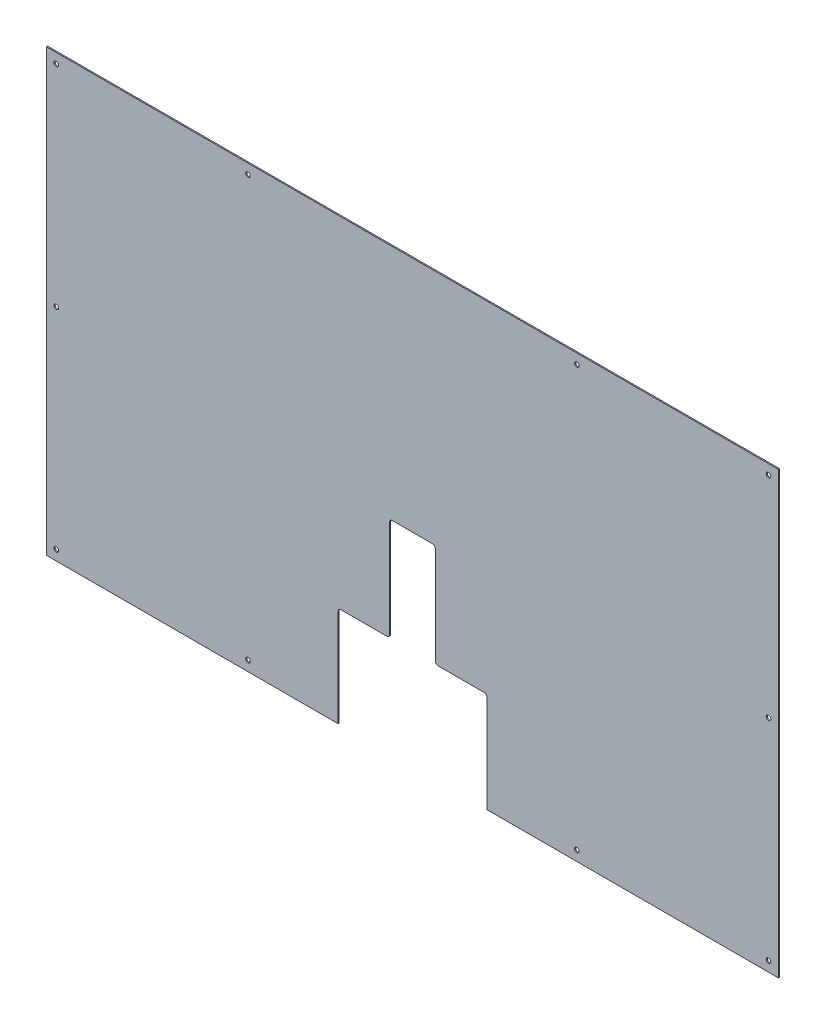
ISO-10303-21;
HEADER;
FILE_DESCRIPTION(('STEP AP214'),'2;1');
FILE_NAME('part.step','',(''),(''),'','','');
FILE_SCHEMA(('AUTOMOTIVE_DESIGN { 1 0 10303 214 1 1 1 1 }'));
ENDSEC;
DATA;
#1=APPLICATION_CONTEXT('core data for automotive mechanical design processes');
#2=APPLICATION_PROTOCOL_DEFINITION('international standard','automotive_design',2000,#1);
#3=PRODUCT_CONTEXT('',#1,'mechanical');
#4=PRODUCT('Part','Part','',(#3));
#5=PRODUCT_RELATED_PRODUCT_CATEGORY('part','',(#4));
#6=PRODUCT_DEFINITION_FORMATION('','',#4);
#7=PRODUCT_DEFINITION_CONTEXT('part definition',#1,'design');
#8=PRODUCT_DEFINITION('design','',#6,#7);
#9=PRODUCT_DEFINITION_SHAPE('','',#8);
#10=(LENGTH_UNIT() NAMED_UNIT(*) SI_UNIT(.MILLI.,.METRE.));
#11=(NAMED_UNIT(*) PLANE_ANGLE_UNIT() SI_UNIT($,.RADIAN.));
#12=(NAMED_UNIT(*) SI_UNIT($,.STERADIAN.) SOLID_ANGLE_UNIT());
#13=UNCERTAINTY_MEASURE_WITH_UNIT(LENGTH_MEASURE(1.E-05),#10,'distance_accuracy_value','');
#14=(GEOMETRIC_REPRESENTATION_CONTEXT(3) GLOBAL_UNCERTAINTY_ASSIGNED_CONTEXT((#13)) GLOBAL_UNIT_ASSIGNED_CONTEXT((#10,
#11,#12)) REPRESENTATION_CONTEXT('',''));
#15=CARTESIAN_POINT('',(0.,0.,0.));
#16=DIRECTION('',(0.,0.,1.));
#17=DIRECTION('',(1.,0.,0.));
#18=AXIS2_PLACEMENT_3D('',#15,#16,#17);
#19=CARTESIAN_POINT('',(765.,170.,2.));
#20=DIRECTION('',(0.,0.,1.));
#21=DIRECTION('',(1.,0.,0.));
#22=AXIS2_PLACEMENT_3D('',#19,#20,#21);
#23=PLANE('',#22);
#24=CARTESIAN_POINT('',(17.5000000000001,385.,2.));
#25=DIRECTION('',(0.,0.,1.));
#26=DIRECTION('',(1.,0.,0.));
#27=AXIS2_PLACEMENT_3D('',#24,#25,#26);
#28=CIRCLE('',#27,4.);
#29=CARTESIAN_POINT('',(21.5000000000001,385.,2.));
#30=VERTEX_POINT('',#29);
#31=EDGE_CURVE('E393',#30,#30,#28,.T.);
#32=ORIENTED_EDGE('',*,*,#31,.F.);
#33=EDGE_LOOP('',(#32));
#34=FACE_BOUND('',#33,.T.);
#35=CARTESIAN_POINT('',(927.5,17.5,2.));
#36=DIRECTION('',(0.,0.,1.));
#37=DIRECTION('',(1.,0.,0.));
#38=AXIS2_PLACEMENT_3D('',#35,#36,#37);
#39=CIRCLE('',#38,3.99999999999999);
#40=CARTESIAN_POINT('',(931.5,17.5,2.));
#41=VERTEX_POINT('',#40);
#42=EDGE_CURVE('E405',#41,#41,#39,.T.);
#43=ORIENTED_EDGE('',*,*,#42,.F.);
#44=EDGE_LOOP('',(#43));
#45=FACE_BOUND('',#44,.T.);
#46=CARTESIAN_POINT('',(352.5,752.5,2.));
#47=DIRECTION('',(0.,0.,1.));
#48=DIRECTION('',(1.,0.,0.));
#49=AXIS2_PLACEMENT_3D('',#46,#47,#48);
#50=CIRCLE('',#49,3.99999999999999);
#51=CARTESIAN_POINT('',(356.5,752.5,2.));
#52=VERTEX_POINT('',#51);
#53=EDGE_CURVE('E417',#52,#52,#50,.T.);
#54=ORIENTED_EDGE('',*,*,#53,.F.);
#55=EDGE_LOOP('',(#54));
#56=FACE_BOUND('',#55,.T.);
#57=CARTESIAN_POINT('',(1262.5,17.5,2.));
#58=DIRECTION('',(0.,0.,1.));
#59=DIRECTION('',(1.,0.,0.));
#60=AXIS2_PLACEMENT_3D('',#57,#58,#59);
#61=CIRCLE('',#60,4.00000000000021);
#62=CARTESIAN_POINT('',(1266.5,17.5,2.));
#63=VERTEX_POINT('',#62);
#64=EDGE_CURVE('E429',#63,#63,#61,.T.);
#65=ORIENTED_EDGE('',*,*,#64,.F.);
#66=EDGE_LOOP('',(#65));
#67=FACE_BOUND('',#66,.T.);
#68=CARTESIAN_POINT('',(17.5,752.5,2.));
#69=DIRECTION('',(0.,0.,1.));
#70=DIRECTION('',(1.,0.,0.));
#71=AXIS2_PLACEMENT_3D('',#68,#69,#70);
#72=CIRCLE('',#71,4.);
#73=CARTESIAN_POINT('',(21.5,752.5,2.));
#74=VERTEX_POINT('',#73);
#75=EDGE_CURVE('E193',#74,#74,#72,.T.);
#76=ORIENTED_EDGE('',*,*,#75,.F.);
#77=EDGE_LOOP('',(#76));
#78=FACE_BOUND('',#77,.T.);
#79=DIRECTION('',(1.,0.,0.));
#80=VECTOR('',#79,1.);
#81=CARTESIAN_POINT('',(510.,0.,2.));
#82=LINE('',#81,#80);
#83=CARTESIAN_POINT('',(0.,0.,2.));
#84=VERTEX_POINT('',#83);
#85=CARTESIAN_POINT('',(510.,0.,2.));
#86=VERTEX_POINT('',#85);
#87=EDGE_CURVE('E224',#84,#86,#82,.T.);
#88=ORIENTED_EDGE('',*,*,#87,.T.);
#89=DIRECTION('',(0.,1.,0.));
#90=VECTOR('',#89,1.);
#91=CARTESIAN_POINT('',(510.,0.,2.));
#92=LINE('',#91,#90);
#93=CARTESIAN_POINT('',(510.,170.,2.));
#94=VERTEX_POINT('',#93);
#95=EDGE_CURVE('E122',#86,#94,#92,.T.);
#96=ORIENTED_EDGE('',*,*,#95,.T.);
#97=CARTESIAN_POINT('',(515.,170.,2.));
#98=DIRECTION('',(0.,0.,-1.));
#99=DIRECTION('',(-1.,0.,0.));
#100=AXIS2_PLACEMENT_3D('',#97,#98,#99);
#101=CIRCLE('',#100,4.99999999999999);
#102=CARTESIAN_POINT('',(515.,175.,2.));
#103=VERTEX_POINT('',#102);
#104=EDGE_CURVE('E269',#94,#103,#101,.T.);
#105=ORIENTED_EDGE('',*,*,#104,.T.);
#106=DIRECTION('',(1.,0.,0.));
#107=VECTOR('',#106,1.);
#108=CARTESIAN_POINT('',(515.,175.,2.));
#109=LINE('',#108,#107);
#110=CARTESIAN_POINT('',(595.,175.,2.));
#111=VERTEX_POINT('',#110);
#112=EDGE_CURVE('E288',#103,#111,#109,.T.);
#113=ORIENTED_EDGE('',*,*,#112,.T.);
#114=CARTESIAN_POINT('',(595.,180.,2.));
#115=DIRECTION('',(0.,0.,1.));
#116=DIRECTION('',(1.,0.,0.));
#117=AXIS2_PLACEMENT_3D('',#114,#115,#116);
#118=CIRCLE('',#117,5.00000000000002);
#119=CARTESIAN_POINT('',(600.,180.,2.));
#120=VERTEX_POINT('',#119);
#121=EDGE_CURVE('E285',#111,#120,#118,.T.);
#122=ORIENTED_EDGE('',*,*,#121,.T.);
#123=DIRECTION('',(0.,1.,0.));
#124=VECTOR('',#123,1.);
#125=CARTESIAN_POINT('',(600.,180.,2.));
#126=LINE('',#125,#124);
#127=CARTESIAN_POINT('',(600.,350.,2.));
#128=VERTEX_POINT('',#127);
#129=EDGE_CURVE('E287',#120,#128,#126,.T.);
#130=ORIENTED_EDGE('',*,*,#129,.T.);
#131=CARTESIAN_POINT('',(605.,350.,2.));
#132=DIRECTION('',(0.,0.,-1.));
#133=DIRECTION('',(1.,0.,0.));
#134=AXIS2_PLACEMENT_3D('',#131,#132,#133);
#135=CIRCLE('',#134,4.99999999999998);
#136=CARTESIAN_POINT('',(605.,355.,2.));
#137=VERTEX_POINT('',#136);
#138=EDGE_CURVE('E290',#128,#137,#135,.T.);
#139=ORIENTED_EDGE('',*,*,#138,.T.);
#140=DIRECTION('',(1.,0.,0.));
#141=VECTOR('',#140,1.);
#142=CARTESIAN_POINT('',(605.,355.,2.));
#143=LINE('',#142,#141);
#144=CARTESIAN_POINT('',(675.,355.,2.));
#145=VERTEX_POINT('',#144);
#146=EDGE_CURVE('E296',#137,#145,#143,.T.);
#147=ORIENTED_EDGE('',*,*,#146,.T.);
#148=CARTESIAN_POINT('',(675.,350.,2.));
#149=DIRECTION('',(0.,0.,-1.));
#150=DIRECTION('',(1.,0.,0.));
#151=AXIS2_PLACEMENT_3D('',#148,#149,#150);
#152=CIRCLE('',#151,5.00000000000006);
#153=CARTESIAN_POINT('',(680.,350.,2.));
#154=VERTEX_POINT('',#153);
#155=EDGE_CURVE('E298',#145,#154,#152,.T.);
#156=ORIENTED_EDGE('',*,*,#155,.T.);
#157=DIRECTION('',(0.,-1.,0.));
#158=VECTOR('',#157,1.);
#159=CARTESIAN_POINT('',(680.,180.,2.));
#160=LINE('',#159,#158);
#161=CARTESIAN_POINT('',(680.,180.,2.));
#162=VERTEX_POINT('',#161);
#163=EDGE_CURVE('E300',#154,#162,#160,.T.);
#164=ORIENTED_EDGE('',*,*,#163,.T.);
#165=CARTESIAN_POINT('',(685.,180.,2.));
#166=DIRECTION('',(0.,0.,1.));
#167=DIRECTION('',(-1.,0.,0.));
#168=AXIS2_PLACEMENT_3D('',#165,#166,#167);
#169=CIRCLE('',#168,4.99999999999995);
#170=CARTESIAN_POINT('',(685.,175.,2.));
#171=VERTEX_POINT('',#170);
#172=EDGE_CURVE('E302',#162,#171,#169,.T.);
#173=ORIENTED_EDGE('',*,*,#172,.T.);
#174=DIRECTION('',(1.,0.,0.));
#175=VECTOR('',#174,1.);
#176=CARTESIAN_POINT('',(765.,175.,2.));
#177=LINE('',#176,#175);
#178=CARTESIAN_POINT('',(765.,175.,2.));
#179=VERTEX_POINT('',#178);
#180=EDGE_CURVE('E304',#171,#179,#177,.T.);
#181=ORIENTED_EDGE('',*,*,#180,.T.);
#182=CARTESIAN_POINT('',(765.,170.,2.));
#183=DIRECTION('',(0.,0.,-1.));
#184=DIRECTION('',(1.,0.,0.));
#185=AXIS2_PLACEMENT_3D('',#182,#183,#184);
#186=CIRCLE('',#185,5.);
#187=CARTESIAN_POINT('',(770.,170.,2.));
#188=VERTEX_POINT('',#187);
#189=EDGE_CURVE('E306',#179,#188,#186,.T.);
#190=ORIENTED_EDGE('',*,*,#189,.T.);
#191=DIRECTION('',(0.,-1.,0.));
#192=VECTOR('',#191,1.);
#193=CARTESIAN_POINT('',(770.,0.,2.));
#194=LINE('',#193,#192);
#195=CARTESIAN_POINT('',(770.,0.,2.));
#196=VERTEX_POINT('',#195);
#197=EDGE_CURVE('E308',#188,#196,#194,.T.);
#198=ORIENTED_EDGE('',*,*,#197,.T.);
#199=DIRECTION('',(1.,0.,0.));
#200=VECTOR('',#199,1.);
#201=CARTESIAN_POINT('',(1280.,1.43917779840921E-13,2.));
#202=LINE('',#201,#200);
#203=CARTESIAN_POINT('',(1280.,1.43917779840921E-13,2.));
#204=VERTEX_POINT('',#203);
#205=EDGE_CURVE('E171',#196,#204,#202,.T.);
#206=ORIENTED_EDGE('',*,*,#205,.T.);
#207=DIRECTION('',(0.,1.,0.));
#208=VECTOR('',#207,1.);
#209=CARTESIAN_POINT('',(1280.,770.,2.));
#210=LINE('',#209,#208);
#211=CARTESIAN_POINT('',(1280.,770.,2.));
#212=VERTEX_POINT('',#211);
#213=EDGE_CURVE('E165',#204,#212,#210,.T.);
#214=ORIENTED_EDGE('',*,*,#213,.T.);
#215=DIRECTION('',(-1.,0.,0.));
#216=VECTOR('',#215,1.);
#217=CARTESIAN_POINT('',(0.,770.,2.));
#218=LINE('',#217,#216);
#219=CARTESIAN_POINT('',(0.,770.,2.));
#220=VERTEX_POINT('',#219);
#221=EDGE_CURVE('E169',#212,#220,#218,.T.);
#222=ORIENTED_EDGE('',*,*,#221,.T.);
#223=DIRECTION('',(0.,-1.,0.));
#224=VECTOR('',#223,1.);
#225=CARTESIAN_POINT('',(0.,0.,2.));
#226=LINE('',#225,#224);
#227=EDGE_CURVE('E49',#220,#84,#226,.T.);
#228=ORIENTED_EDGE('',*,*,#227,.T.);
#229=EDGE_LOOP('',(#88,#96,#105,#113,#122,#130,#139,#147,#156,#164,#173,#181,#190,#198,#206,
#214,#222,#228));
#230=FACE_BOUND('',#229,.T.);
#231=CARTESIAN_POINT('',(1262.5,752.5,2.));
#232=DIRECTION('',(0.,0.,1.));
#233=DIRECTION('',(-1.,0.,0.));
#234=AXIS2_PLACEMENT_3D('',#231,#232,#233);
#235=CIRCLE('',#234,4.00000000000024);
#236=CARTESIAN_POINT('',(1258.5,752.5,2.));
#237=VERTEX_POINT('',#236);
#238=EDGE_CURVE('E435',#237,#237,#235,.T.);
#239=ORIENTED_EDGE('',*,*,#238,.F.);
#240=EDGE_LOOP('',(#239));
#241=FACE_BOUND('',#240,.T.);
#242=CARTESIAN_POINT('',(17.5,17.5,2.));
#243=DIRECTION('',(0.,0.,1.));
#244=DIRECTION('',(-1.,0.,0.));
#245=AXIS2_PLACEMENT_3D('',#242,#243,#244);
#246=CIRCLE('',#245,4.);
#247=CARTESIAN_POINT('',(13.5,17.5,2.));
#248=VERTEX_POINT('',#247);
#249=EDGE_CURVE('E423',#248,#248,#246,.T.);
#250=ORIENTED_EDGE('',*,*,#249,.F.);
#251=EDGE_LOOP('',(#250));
#252=FACE_BOUND('',#251,.T.);
#253=CARTESIAN_POINT('',(927.5,752.5,2.));
#254=DIRECTION('',(0.,0.,1.));
#255=DIRECTION('',(-1.,0.,0.));
#256=AXIS2_PLACEMENT_3D('',#253,#254,#255);
#257=CIRCLE('',#256,3.99999999999999);
#258=CARTESIAN_POINT('',(923.5,752.5,2.));
#259=VERTEX_POINT('',#258);
#260=EDGE_CURVE('E411',#259,#259,#257,.T.);
#261=ORIENTED_EDGE('',*,*,#260,.F.);
#262=EDGE_LOOP('',(#261));
#263=FACE_BOUND('',#262,.T.);
#264=CARTESIAN_POINT('',(352.5,17.5,2.));
#265=DIRECTION('',(0.,0.,1.));
#266=DIRECTION('',(-1.,0.,0.));
#267=AXIS2_PLACEMENT_3D('',#264,#265,#266);
#268=CIRCLE('',#267,3.99999999999999);
#269=CARTESIAN_POINT('',(348.5,17.5,2.));
#270=VERTEX_POINT('',#269);
#271=EDGE_CURVE('E399',#270,#270,#268,.T.);
#272=ORIENTED_EDGE('',*,*,#271,.F.);
#273=EDGE_LOOP('',(#272));
#274=FACE_BOUND('',#273,.T.);
#275=CARTESIAN_POINT('',(1262.5,385.,2.));
#276=DIRECTION('',(0.,0.,1.));
#277=DIRECTION('',(-1.,0.,0.));
#278=AXIS2_PLACEMENT_3D('',#275,#276,#277);
#279=CIRCLE('',#278,3.99999999999999);
#280=CARTESIAN_POINT('',(1258.5,385.,2.));
#281=VERTEX_POINT('',#280);
#282=EDGE_CURVE('E384',#281,#281,#279,.T.);
#283=ORIENTED_EDGE('',*,*,#282,.F.);
#284=EDGE_LOOP('',(#283));
#285=FACE_BOUND('',#284,.T.);
#286=ADVANCED_FACE('F32',(#34,#45,#56,#67,#78,#230,#241,#252,#263,#274,#285),#23,.T.);
#287=CARTESIAN_POINT('',(765.,170.,0.));
#288=DIRECTION('',(0.,0.,1.));
#289=DIRECTION('',(1.,0.,0.));
#290=AXIS2_PLACEMENT_3D('',#287,#288,#289);
#291=PLANE('',#290);
#292=CARTESIAN_POINT('',(17.5000000000001,385.,0.));
#293=DIRECTION('',(0.,0.,1.));
#294=DIRECTION('',(1.,0.,0.));
#295=AXIS2_PLACEMENT_3D('',#292,#293,#294);
#296=CIRCLE('',#295,4.);
#297=CARTESIAN_POINT('',(21.5000000000001,385.,0.));
#298=VERTEX_POINT('',#297);
#299=EDGE_CURVE('E390',#298,#298,#296,.T.);
#300=ORIENTED_EDGE('',*,*,#299,.T.);
#301=EDGE_LOOP('',(#300));
#302=FACE_BOUND('',#301,.T.);
#303=CARTESIAN_POINT('',(927.5,17.5,0.));
#304=DIRECTION('',(0.,0.,1.));
#305=DIRECTION('',(1.,0.,0.));
#306=AXIS2_PLACEMENT_3D('',#303,#304,#305);
#307=CIRCLE('',#306,3.99999999999999);
#308=CARTESIAN_POINT('',(931.5,17.5,0.));
#309=VERTEX_POINT('',#308);
#310=EDGE_CURVE('E402',#309,#309,#307,.T.);
#311=ORIENTED_EDGE('',*,*,#310,.T.);
#312=EDGE_LOOP('',(#311));
#313=FACE_BOUND('',#312,.T.);
#314=CARTESIAN_POINT('',(352.5,752.5,0.));
#315=DIRECTION('',(0.,0.,1.));
#316=DIRECTION('',(1.,0.,0.));
#317=AXIS2_PLACEMENT_3D('',#314,#315,#316);
#318=CIRCLE('',#317,3.99999999999999);
#319=CARTESIAN_POINT('',(356.5,752.5,0.));
#320=VERTEX_POINT('',#319);
#321=EDGE_CURVE('E414',#320,#320,#318,.T.);
#322=ORIENTED_EDGE('',*,*,#321,.T.);
#323=EDGE_LOOP('',(#322));
#324=FACE_BOUND('',#323,.T.);
#325=CARTESIAN_POINT('',(1262.5,17.5,0.));
#326=DIRECTION('',(0.,0.,1.));
#327=DIRECTION('',(1.,0.,0.));
#328=AXIS2_PLACEMENT_3D('',#325,#326,#327);
#329=CIRCLE('',#328,4.00000000000021);
#330=CARTESIAN_POINT('',(1266.5,17.5,0.));
#331=VERTEX_POINT('',#330);
#332=EDGE_CURVE('E426',#331,#331,#329,.T.);
#333=ORIENTED_EDGE('',*,*,#332,.T.);
#334=EDGE_LOOP('',(#333));
#335=FACE_BOUND('',#334,.T.);
#336=CARTESIAN_POINT('',(17.5,752.5,0.));
#337=DIRECTION('',(0.,0.,1.));
#338=DIRECTION('',(1.,0.,0.));
#339=AXIS2_PLACEMENT_3D('',#336,#337,#338);
#340=CIRCLE('',#339,4.);
#341=CARTESIAN_POINT('',(21.5,752.5,0.));
#342=VERTEX_POINT('',#341);
#343=EDGE_CURVE('E438',#342,#342,#340,.T.);
#344=ORIENTED_EDGE('',*,*,#343,.T.);
#345=EDGE_LOOP('',(#344));
#346=FACE_BOUND('',#345,.T.);
#347=DIRECTION('',(1.,0.,0.));
#348=VECTOR('',#347,1.);
#349=CARTESIAN_POINT('',(510.,0.,0.));
#350=LINE('',#349,#348);
#351=CARTESIAN_POINT('',(0.,0.,0.));
#352=VERTEX_POINT('',#351);
#353=CARTESIAN_POINT('',(510.,0.,0.));
#354=VERTEX_POINT('',#353);
#355=EDGE_CURVE('E189',#352,#354,#350,.T.);
#356=ORIENTED_EDGE('',*,*,#355,.F.);
#357=DIRECTION('',(0.,-1.,0.));
#358=VECTOR('',#357,1.);
#359=CARTESIAN_POINT('',(0.,0.,0.));
#360=LINE('',#359,#358);
#361=CARTESIAN_POINT('',(0.,770.,0.));
#362=VERTEX_POINT('',#361);
#363=EDGE_CURVE('E114',#362,#352,#360,.T.);
#364=ORIENTED_EDGE('',*,*,#363,.F.);
#365=DIRECTION('',(-1.,0.,0.));
#366=VECTOR('',#365,1.);
#367=CARTESIAN_POINT('',(0.,770.,0.));
#368=LINE('',#367,#366);
#369=CARTESIAN_POINT('',(1280.,770.,0.));
#370=VERTEX_POINT('',#369);
#371=EDGE_CURVE('E108',#370,#362,#368,.T.);
#372=ORIENTED_EDGE('',*,*,#371,.F.);
#373=DIRECTION('',(0.,1.,0.));
#374=VECTOR('',#373,1.);
#375=CARTESIAN_POINT('',(1280.,770.,0.));
#376=LINE('',#375,#374);
#377=CARTESIAN_POINT('',(1280.,1.43917779840921E-13,0.));
#378=VERTEX_POINT('',#377);
#379=EDGE_CURVE('E179',#378,#370,#376,.T.);
#380=ORIENTED_EDGE('',*,*,#379,.F.);
#381=DIRECTION('',(1.,0.,0.));
#382=VECTOR('',#381,1.);
#383=CARTESIAN_POINT('',(1280.,1.43917779840921E-13,0.));
#384=LINE('',#383,#382);
#385=CARTESIAN_POINT('',(770.,0.,0.));
#386=VERTEX_POINT('',#385);
#387=EDGE_CURVE('E219',#386,#378,#384,.T.);
#388=ORIENTED_EDGE('',*,*,#387,.F.);
#389=DIRECTION('',(0.,-1.,0.));
#390=VECTOR('',#389,1.);
#391=CARTESIAN_POINT('',(770.,0.,0.));
#392=LINE('',#391,#390);
#393=CARTESIAN_POINT('',(770.,170.,0.));
#394=VERTEX_POINT('',#393);
#395=EDGE_CURVE('E217',#394,#386,#392,.T.);
#396=ORIENTED_EDGE('',*,*,#395,.F.);
#397=CARTESIAN_POINT('',(765.,170.,0.));
#398=DIRECTION('',(0.,0.,-1.));
#399=DIRECTION('',(1.,0.,0.));
#400=AXIS2_PLACEMENT_3D('',#397,#398,#399);
#401=CIRCLE('',#400,5.);
#402=CARTESIAN_POINT('',(765.,175.,0.));
#403=VERTEX_POINT('',#402);
#404=EDGE_CURVE('E215',#403,#394,#401,.T.);
#405=ORIENTED_EDGE('',*,*,#404,.F.);
#406=DIRECTION('',(1.,0.,0.));
#407=VECTOR('',#406,1.);
#408=CARTESIAN_POINT('',(765.,175.,0.));
#409=LINE('',#408,#407);
#410=CARTESIAN_POINT('',(685.,175.,0.));
#411=VERTEX_POINT('',#410);
#412=EDGE_CURVE('E213',#411,#403,#409,.T.);
#413=ORIENTED_EDGE('',*,*,#412,.F.);
#414=CARTESIAN_POINT('',(685.,180.,0.));
#415=DIRECTION('',(0.,0.,1.));
#416=DIRECTION('',(-1.,0.,0.));
#417=AXIS2_PLACEMENT_3D('',#414,#415,#416);
#418=CIRCLE('',#417,4.99999999999995);
#419=CARTESIAN_POINT('',(680.,180.,0.));
#420=VERTEX_POINT('',#419);
#421=EDGE_CURVE('E211',#420,#411,#418,.T.);
#422=ORIENTED_EDGE('',*,*,#421,.F.);
#423=DIRECTION('',(0.,-1.,0.));
#424=VECTOR('',#423,1.);
#425=CARTESIAN_POINT('',(680.,180.,0.));
#426=LINE('',#425,#424);
#427=CARTESIAN_POINT('',(680.,350.,0.));
#428=VERTEX_POINT('',#427);
#429=EDGE_CURVE('E209',#428,#420,#426,.T.);
#430=ORIENTED_EDGE('',*,*,#429,.F.);
#431=CARTESIAN_POINT('',(675.,350.,0.));
#432=DIRECTION('',(0.,0.,-1.));
#433=DIRECTION('',(1.,0.,0.));
#434=AXIS2_PLACEMENT_3D('',#431,#432,#433);
#435=CIRCLE('',#434,5.00000000000006);
#436=CARTESIAN_POINT('',(675.,355.,0.));
#437=VERTEX_POINT('',#436);
#438=EDGE_CURVE('E207',#437,#428,#435,.T.);
#439=ORIENTED_EDGE('',*,*,#438,.F.);
#440=DIRECTION('',(1.,0.,0.));
#441=VECTOR('',#440,1.);
#442=CARTESIAN_POINT('',(605.,355.,0.));
#443=LINE('',#442,#441);
#444=CARTESIAN_POINT('',(605.,355.,0.));
#445=VERTEX_POINT('',#444);
#446=EDGE_CURVE('E205',#445,#437,#443,.T.);
#447=ORIENTED_EDGE('',*,*,#446,.F.);
#448=CARTESIAN_POINT('',(605.,350.,0.));
#449=DIRECTION('',(0.,0.,-1.));
#450=DIRECTION('',(1.,0.,0.));
#451=AXIS2_PLACEMENT_3D('',#448,#449,#450);
#452=CIRCLE('',#451,4.99999999999998);
#453=CARTESIAN_POINT('',(600.,350.,0.));
#454=VERTEX_POINT('',#453);
#455=EDGE_CURVE('E203',#454,#445,#452,.T.);
#456=ORIENTED_EDGE('',*,*,#455,.F.);
#457=DIRECTION('',(0.,1.,0.));
#458=VECTOR('',#457,1.);
#459=CARTESIAN_POINT('',(600.,180.,0.));
#460=LINE('',#459,#458);
#461=CARTESIAN_POINT('',(600.,180.,0.));
#462=VERTEX_POINT('',#461);
#463=EDGE_CURVE('E201',#462,#454,#460,.T.);
#464=ORIENTED_EDGE('',*,*,#463,.F.);
#465=CARTESIAN_POINT('',(595.,180.,0.));
#466=DIRECTION('',(0.,0.,1.));
#467=DIRECTION('',(1.,0.,0.));
#468=AXIS2_PLACEMENT_3D('',#465,#466,#467);
#469=CIRCLE('',#468,5.00000000000002);
#470=CARTESIAN_POINT('',(595.,175.,0.));
#471=VERTEX_POINT('',#470);
#472=EDGE_CURVE('E199',#471,#462,#469,.T.);
#473=ORIENTED_EDGE('',*,*,#472,.F.);
#474=DIRECTION('',(1.,0.,0.));
#475=VECTOR('',#474,1.);
#476=CARTESIAN_POINT('',(515.,175.,0.));
#477=LINE('',#476,#475);
#478=CARTESIAN_POINT('',(515.,175.,0.));
#479=VERTEX_POINT('',#478);
#480=EDGE_CURVE('E197',#479,#471,#477,.T.);
#481=ORIENTED_EDGE('',*,*,#480,.F.);
#482=CARTESIAN_POINT('',(515.,170.,0.));
#483=DIRECTION('',(0.,0.,-1.));
#484=DIRECTION('',(-1.,0.,0.));
#485=AXIS2_PLACEMENT_3D('',#482,#483,#484);
#486=CIRCLE('',#485,4.99999999999999);
#487=CARTESIAN_POINT('',(510.,170.,0.));
#488=VERTEX_POINT('',#487);
#489=EDGE_CURVE('E195',#488,#479,#486,.T.);
#490=ORIENTED_EDGE('',*,*,#489,.F.);
#491=DIRECTION('',(0.,1.,0.));
#492=VECTOR('',#491,1.);
#493=CARTESIAN_POINT('',(510.,0.,0.));
#494=LINE('',#493,#492);
#495=EDGE_CURVE('E192',#354,#488,#494,.T.);
#496=ORIENTED_EDGE('',*,*,#495,.F.);
#497=EDGE_LOOP('',(#356,#364,#372,#380,#388,#396,#405,#413,#422,#430,#439,#447,#456,#464,#473,
#481,#490,#496));
#498=FACE_BOUND('',#497,.T.);
#499=CARTESIAN_POINT('',(1262.5,752.5,0.));
#500=DIRECTION('',(0.,0.,1.));
#501=DIRECTION('',(-1.,0.,0.));
#502=AXIS2_PLACEMENT_3D('',#499,#500,#501);
#503=CIRCLE('',#502,4.00000000000024);
#504=CARTESIAN_POINT('',(1258.5,752.5,0.));
#505=VERTEX_POINT('',#504);
#506=EDGE_CURVE('E432',#505,#505,#503,.T.);
#507=ORIENTED_EDGE('',*,*,#506,.T.);
#508=EDGE_LOOP('',(#507));
#509=FACE_BOUND('',#508,.T.);
#510=CARTESIAN_POINT('',(17.5,17.5,0.));
#511=DIRECTION('',(0.,0.,1.));
#512=DIRECTION('',(-1.,0.,0.));
#513=AXIS2_PLACEMENT_3D('',#510,#511,#512);
#514=CIRCLE('',#513,4.);
#515=CARTESIAN_POINT('',(13.5,17.5,0.));
#516=VERTEX_POINT('',#515);
#517=EDGE_CURVE('E420',#516,#516,#514,.T.);
#518=ORIENTED_EDGE('',*,*,#517,.T.);
#519=EDGE_LOOP('',(#518));
#520=FACE_BOUND('',#519,.T.);
#521=CARTESIAN_POINT('',(927.5,752.5,0.));
#522=DIRECTION('',(0.,0.,1.));
#523=DIRECTION('',(-1.,0.,0.));
#524=AXIS2_PLACEMENT_3D('',#521,#522,#523);
#525=CIRCLE('',#524,3.99999999999999);
#526=CARTESIAN_POINT('',(923.5,752.5,0.));
#527=VERTEX_POINT('',#526);
#528=EDGE_CURVE('E408',#527,#527,#525,.T.);
#529=ORIENTED_EDGE('',*,*,#528,.T.);
#530=EDGE_LOOP('',(#529));
#531=FACE_BOUND('',#530,.T.);
#532=CARTESIAN_POINT('',(352.5,17.5,0.));
#533=DIRECTION('',(0.,0.,1.));
#534=DIRECTION('',(-1.,0.,0.));
#535=AXIS2_PLACEMENT_3D('',#532,#533,#534);
#536=CIRCLE('',#535,3.99999999999999);
#537=CARTESIAN_POINT('',(348.5,17.5,0.));
#538=VERTEX_POINT('',#537);
#539=EDGE_CURVE('E396',#538,#538,#536,.T.);
#540=ORIENTED_EDGE('',*,*,#539,.T.);
#541=EDGE_LOOP('',(#540));
#542=FACE_BOUND('',#541,.T.);
#543=CARTESIAN_POINT('',(1262.5,385.,0.));
#544=DIRECTION('',(0.,0.,1.));
#545=DIRECTION('',(-1.,0.,0.));
#546=AXIS2_PLACEMENT_3D('',#543,#544,#545);
#547=CIRCLE('',#546,3.99999999999999);
#548=CARTESIAN_POINT('',(1258.5,385.,0.));
#549=VERTEX_POINT('',#548);
#550=EDGE_CURVE('E387',#549,#549,#547,.T.);
#551=ORIENTED_EDGE('',*,*,#550,.T.);
#552=EDGE_LOOP('',(#551));
#553=FACE_BOUND('',#552,.T.);
#554=ADVANCED_FACE('F273',(#302,#313,#324,#335,#346,#498,#509,#520,#531,#542,#553),#291,.F.);
#555=CARTESIAN_POINT('',(510.,0.,2.));
#556=DIRECTION('',(0.,1.,0.));
#557=DIRECTION('',(-1.,0.,0.));
#558=AXIS2_PLACEMENT_3D('',#555,#556,#557);
#559=PLANE('',#558);
#560=ORIENTED_EDGE('',*,*,#355,.T.);
#561=DIRECTION('',(0.,0.,-1.));
#562=VECTOR('',#561,1.);
#563=CARTESIAN_POINT('',(510.,0.,2.));
#564=LINE('',#563,#562);
#565=EDGE_CURVE('E11',#86,#354,#564,.T.);
#566=ORIENTED_EDGE('',*,*,#565,.F.);
#567=ORIENTED_EDGE('',*,*,#87,.F.);
#568=DIRECTION('',(0.,0.,-1.));
#569=VECTOR('',#568,1.);
#570=CARTESIAN_POINT('',(0.,0.,2.));
#571=LINE('',#570,#569);
#572=EDGE_CURVE('E185',#84,#352,#571,.T.);
#573=ORIENTED_EDGE('',*,*,#572,.T.);
#574=EDGE_LOOP('',(#560,#566,#567,#573));
#575=FACE_BOUND('',#574,.T.);
#576=ADVANCED_FACE('F34',(#575),#559,.F.);
#577=CARTESIAN_POINT('',(510.,0.,2.));
#578=DIRECTION('',(-1.,0.,0.));
#579=DIRECTION('',(0.,0.,1.));
#580=AXIS2_PLACEMENT_3D('',#577,#578,#579);
#581=PLANE('',#580);
#582=ORIENTED_EDGE('',*,*,#495,.T.);
#583=DIRECTION('',(0.,0.,-1.));
#584=VECTOR('',#583,1.);
#585=CARTESIAN_POINT('',(510.,170.,2.));
#586=LINE('',#585,#584);
#587=EDGE_CURVE('E41',#94,#488,#586,.T.);
#588=ORIENTED_EDGE('',*,*,#587,.F.);
#589=ORIENTED_EDGE('',*,*,#95,.F.);
#590=ORIENTED_EDGE('',*,*,#565,.T.);
#591=EDGE_LOOP('',(#582,#588,#589,#590));
#592=FACE_BOUND('',#591,.T.);
#593=ADVANCED_FACE('F661',(#592),#581,.F.);
#594=CARTESIAN_POINT('',(515.,170.,2.));
#595=DIRECTION('',(0.,0.,-1.));
#596=DIRECTION('',(-1.,0.,0.));
#597=AXIS2_PLACEMENT_3D('',#594,#595,#596);
#598=CYLINDRICAL_SURFACE('',#597,4.99999999999999);
#599=ORIENTED_EDGE('',*,*,#489,.T.);
#600=DIRECTION('',(0.,0.,-1.));
#601=VECTOR('',#600,1.);
#602=CARTESIAN_POINT('',(515.,175.,2.));
#603=LINE('',#602,#601);
#604=EDGE_CURVE('E261',#103,#479,#603,.T.);
#605=ORIENTED_EDGE('',*,*,#604,.F.);
#606=ORIENTED_EDGE('',*,*,#104,.F.);
#607=ORIENTED_EDGE('',*,*,#587,.T.);
#608=EDGE_LOOP('',(#599,#605,#606,#607));
#609=FACE_BOUND('',#608,.T.);
#610=ADVANCED_FACE('F267',(#609),#598,.F.);
#611=CARTESIAN_POINT('',(515.,175.,2.));
#612=DIRECTION('',(0.,1.,0.));
#613=DIRECTION('',(0.,0.,1.));
#614=AXIS2_PLACEMENT_3D('',#611,#612,#613);
#615=PLANE('',#614);
#616=ORIENTED_EDGE('',*,*,#480,.T.);
#617=DIRECTION('',(0.,0.,-1.));
#618=VECTOR('',#617,1.);
#619=CARTESIAN_POINT('',(595.,175.,2.));
#620=LINE('',#619,#618);
#621=EDGE_CURVE('E258',#111,#471,#620,.T.);
#622=ORIENTED_EDGE('',*,*,#621,.F.);
#623=ORIENTED_EDGE('',*,*,#112,.F.);
#624=ORIENTED_EDGE('',*,*,#604,.T.);
#625=EDGE_LOOP('',(#616,#622,#623,#624));
#626=FACE_BOUND('',#625,.T.);
#627=ADVANCED_FACE('F279',(#626),#615,.F.);
#628=CARTESIAN_POINT('',(595.,180.,2.));
#629=DIRECTION('',(0.,0.,-1.));
#630=DIRECTION('',(-1.,0.,0.));
#631=AXIS2_PLACEMENT_3D('',#628,#629,#630);
#632=CYLINDRICAL_SURFACE('',#631,5.00000000000002);
#633=ORIENTED_EDGE('',*,*,#472,.T.);
#634=DIRECTION('',(0.,0.,-1.));
#635=VECTOR('',#634,1.);
#636=CARTESIAN_POINT('',(600.,180.,2.));
#637=LINE('',#636,#635);
#638=EDGE_CURVE('E255',#120,#462,#637,.T.);
#639=ORIENTED_EDGE('',*,*,#638,.F.);
#640=ORIENTED_EDGE('',*,*,#121,.F.);
#641=ORIENTED_EDGE('',*,*,#621,.T.);
#642=EDGE_LOOP('',(#633,#639,#640,#641));
#643=FACE_BOUND('',#642,.T.);
#644=ADVANCED_FACE('F283',(#643),#632,.T.);
#645=CARTESIAN_POINT('',(600.,180.,2.));
#646=DIRECTION('',(-1.,0.,0.));
#647=DIRECTION('',(0.,0.,1.));
#648=AXIS2_PLACEMENT_3D('',#645,#646,#647);
#649=PLANE('',#648);
#650=ORIENTED_EDGE('',*,*,#463,.T.);
#651=DIRECTION('',(0.,0.,-1.));
#652=VECTOR('',#651,1.);
#653=CARTESIAN_POINT('',(600.,350.,2.));
#654=LINE('',#653,#652);
#655=EDGE_CURVE('E252',#128,#454,#654,.T.);
#656=ORIENTED_EDGE('',*,*,#655,.F.);
#657=ORIENTED_EDGE('',*,*,#129,.F.);
#658=ORIENTED_EDGE('',*,*,#638,.T.);
#659=EDGE_LOOP('',(#650,#656,#657,#658));
#660=FACE_BOUND('',#659,.T.);
#661=ADVANCED_FACE('F626',(#660),#649,.F.);
#662=CARTESIAN_POINT('',(605.,350.,2.));
#663=DIRECTION('',(0.,0.,-1.));
#664=DIRECTION('',(-1.,0.,0.));
#665=AXIS2_PLACEMENT_3D('',#662,#663,#664);
#666=CYLINDRICAL_SURFACE('',#665,4.99999999999998);
#667=ORIENTED_EDGE('',*,*,#455,.T.);
#668=DIRECTION('',(0.,0.,-1.));
#669=VECTOR('',#668,1.);
#670=CARTESIAN_POINT('',(605.,355.,2.));
#671=LINE('',#670,#669);
#672=EDGE_CURVE('E249',#137,#445,#671,.T.);
#673=ORIENTED_EDGE('',*,*,#672,.F.);
#674=ORIENTED_EDGE('',*,*,#138,.F.);
#675=ORIENTED_EDGE('',*,*,#655,.T.);
#676=EDGE_LOOP('',(#667,#673,#674,#675));
#677=FACE_BOUND('',#676,.T.);
#678=ADVANCED_FACE('F616',(#677),#666,.F.);
#679=CARTESIAN_POINT('',(605.,355.,2.));
#680=DIRECTION('',(0.,1.,0.));
#681=DIRECTION('',(-1.,0.,0.));
#682=AXIS2_PLACEMENT_3D('',#679,#680,#681);
#683=PLANE('',#682);
#684=ORIENTED_EDGE('',*,*,#446,.T.);
#685=DIRECTION('',(0.,0.,-1.));
#686=VECTOR('',#685,1.);
#687=CARTESIAN_POINT('',(675.,355.,2.));
#688=LINE('',#687,#686);
#689=EDGE_CURVE('E246',#145,#437,#688,.T.);
#690=ORIENTED_EDGE('',*,*,#689,.F.);
#691=ORIENTED_EDGE('',*,*,#146,.F.);
#692=ORIENTED_EDGE('',*,*,#672,.T.);
#693=EDGE_LOOP('',(#684,#690,#691,#692));
#694=FACE_BOUND('',#693,.T.);
#695=ADVANCED_FACE('F606',(#694),#683,.F.);
#696=CARTESIAN_POINT('',(675.,350.,2.));
#697=DIRECTION('',(0.,0.,-1.));
#698=DIRECTION('',(-1.,0.,0.));
#699=AXIS2_PLACEMENT_3D('',#696,#697,#698);
#700=CYLINDRICAL_SURFACE('',#699,5.00000000000006);
#701=ORIENTED_EDGE('',*,*,#438,.T.);
#702=DIRECTION('',(0.,0.,-1.));
#703=VECTOR('',#702,1.);
#704=CARTESIAN_POINT('',(680.,350.,2.));
#705=LINE('',#704,#703);
#706=EDGE_CURVE('E243',#154,#428,#705,.T.);
#707=ORIENTED_EDGE('',*,*,#706,.F.);
#708=ORIENTED_EDGE('',*,*,#155,.F.);
#709=ORIENTED_EDGE('',*,*,#689,.T.);
#710=EDGE_LOOP('',(#701,#707,#708,#709));
#711=FACE_BOUND('',#710,.T.);
#712=ADVANCED_FACE('F596',(#711),#700,.F.);
#713=CARTESIAN_POINT('',(680.,180.,2.));
#714=DIRECTION('',(1.,0.,0.));
#715=DIRECTION('',(0.,0.,-1.));
#716=AXIS2_PLACEMENT_3D('',#713,#714,#715);
#717=PLANE('',#716);
#718=ORIENTED_EDGE('',*,*,#429,.T.);
#719=DIRECTION('',(0.,0.,-1.));
#720=VECTOR('',#719,1.);
#721=CARTESIAN_POINT('',(680.,180.,2.));
#722=LINE('',#721,#720);
#723=EDGE_CURVE('E240',#162,#420,#722,.T.);
#724=ORIENTED_EDGE('',*,*,#723,.F.);
#725=ORIENTED_EDGE('',*,*,#163,.F.);
#726=ORIENTED_EDGE('',*,*,#706,.T.);
#727=EDGE_LOOP('',(#718,#724,#725,#726));
#728=FACE_BOUND('',#727,.T.);
#729=ADVANCED_FACE('F586',(#728),#717,.F.);
#730=CARTESIAN_POINT('',(685.,180.,2.));
#731=DIRECTION('',(0.,0.,-1.));
#732=DIRECTION('',(-1.,0.,0.));
#733=AXIS2_PLACEMENT_3D('',#730,#731,#732);
#734=CYLINDRICAL_SURFACE('',#733,4.99999999999995);
#735=ORIENTED_EDGE('',*,*,#421,.T.);
#736=DIRECTION('',(0.,0.,-1.));
#737=VECTOR('',#736,1.);
#738=CARTESIAN_POINT('',(685.,175.,2.));
#739=LINE('',#738,#737);
#740=EDGE_CURVE('E237',#171,#411,#739,.T.);
#741=ORIENTED_EDGE('',*,*,#740,.F.);
#742=ORIENTED_EDGE('',*,*,#172,.F.);
#743=ORIENTED_EDGE('',*,*,#723,.T.);
#744=EDGE_LOOP('',(#735,#741,#742,#743));
#745=FACE_BOUND('',#744,.T.);
#746=ADVANCED_FACE('F576',(#745),#734,.T.);
#747=CARTESIAN_POINT('',(765.,175.,2.));
#748=DIRECTION('',(0.,1.,0.));
#749=DIRECTION('',(0.,0.,1.));
#750=AXIS2_PLACEMENT_3D('',#747,#748,#749);
#751=PLANE('',#750);
#752=ORIENTED_EDGE('',*,*,#412,.T.);
#753=DIRECTION('',(0.,0.,-1.));
#754=VECTOR('',#753,1.);
#755=CARTESIAN_POINT('',(765.,175.,2.));
#756=LINE('',#755,#754);
#757=EDGE_CURVE('E234',#179,#403,#756,.T.);
#758=ORIENTED_EDGE('',*,*,#757,.F.);
#759=ORIENTED_EDGE('',*,*,#180,.F.);
#760=ORIENTED_EDGE('',*,*,#740,.T.);
#761=EDGE_LOOP('',(#752,#758,#759,#760));
#762=FACE_BOUND('',#761,.T.);
#763=ADVANCED_FACE('F566',(#762),#751,.F.);
#764=CARTESIAN_POINT('',(765.,170.,2.));
#765=DIRECTION('',(0.,0.,-1.));
#766=DIRECTION('',(-1.,0.,0.));
#767=AXIS2_PLACEMENT_3D('',#764,#765,#766);
#768=CYLINDRICAL_SURFACE('',#767,5.);
#769=ORIENTED_EDGE('',*,*,#404,.T.);
#770=DIRECTION('',(0.,0.,-1.));
#771=VECTOR('',#770,1.);
#772=CARTESIAN_POINT('',(770.,170.,2.));
#773=LINE('',#772,#771);
#774=EDGE_CURVE('E231',#188,#394,#773,.T.);
#775=ORIENTED_EDGE('',*,*,#774,.F.);
#776=ORIENTED_EDGE('',*,*,#189,.F.);
#777=ORIENTED_EDGE('',*,*,#757,.T.);
#778=EDGE_LOOP('',(#769,#775,#776,#777));
#779=FACE_BOUND('',#778,.T.);
#780=ADVANCED_FACE('F557',(#779),#768,.F.);
#781=CARTESIAN_POINT('',(770.,0.,2.));
#782=DIRECTION('',(1.,0.,0.));
#783=DIRECTION('',(0.,0.,-1.));
#784=AXIS2_PLACEMENT_3D('',#781,#782,#783);
#785=PLANE('',#784);
#786=ORIENTED_EDGE('',*,*,#395,.T.);
#787=DIRECTION('',(0.,0.,-1.));
#788=VECTOR('',#787,1.);
#789=CARTESIAN_POINT('',(770.,0.,2.));
#790=LINE('',#789,#788);
#791=EDGE_CURVE('E228',#196,#386,#790,.T.);
#792=ORIENTED_EDGE('',*,*,#791,.F.);
#793=ORIENTED_EDGE('',*,*,#197,.F.);
#794=ORIENTED_EDGE('',*,*,#774,.T.);
#795=EDGE_LOOP('',(#786,#792,#793,#794));
#796=FACE_BOUND('',#795,.T.);
#797=ADVANCED_FACE('F314',(#796),#785,.F.);
#798=CARTESIAN_POINT('',(1280.,1.43917779840921E-13,2.));
#799=DIRECTION('',(0.,1.,0.));
#800=DIRECTION('',(-1.,0.,0.));
#801=AXIS2_PLACEMENT_3D('',#798,#799,#800);
#802=PLANE('',#801);
#803=ORIENTED_EDGE('',*,*,#387,.T.);
#804=DIRECTION('',(0.,0.,-1.));
#805=VECTOR('',#804,1.);
#806=CARTESIAN_POINT('',(1280.,1.43917779840921E-13,2.));
#807=LINE('',#806,#805);
#808=EDGE_CURVE('E180',#204,#378,#807,.T.);
#809=ORIENTED_EDGE('',*,*,#808,.F.);
#810=ORIENTED_EDGE('',*,*,#205,.F.);
#811=ORIENTED_EDGE('',*,*,#791,.T.);
#812=EDGE_LOOP('',(#803,#809,#810,#811));
#813=FACE_BOUND('',#812,.T.);
#814=ADVANCED_FACE('F318',(#813),#802,.F.);
#815=CARTESIAN_POINT('',(1280.,770.,2.));
#816=DIRECTION('',(-1.,0.,0.));
#817=DIRECTION('',(0.,0.,1.));
#818=AXIS2_PLACEMENT_3D('',#815,#816,#817);
#819=PLANE('',#818);
#820=ORIENTED_EDGE('',*,*,#379,.T.);
#821=DIRECTION('',(0.,0.,-1.));
#822=VECTOR('',#821,1.);
#823=CARTESIAN_POINT('',(1280.,770.,2.));
#824=LINE('',#823,#822);
#825=EDGE_CURVE('E176',#212,#370,#824,.T.);
#826=ORIENTED_EDGE('',*,*,#825,.F.);
#827=ORIENTED_EDGE('',*,*,#213,.F.);
#828=ORIENTED_EDGE('',*,*,#808,.T.);
#829=EDGE_LOOP('',(#820,#826,#827,#828));
#830=FACE_BOUND('',#829,.T.);
#831=ADVANCED_FACE('F177',(#830),#819,.F.);
#832=CARTESIAN_POINT('',(0.,770.,2.));
#833=DIRECTION('',(0.,-1.,0.));
#834=DIRECTION('',(1.,0.,0.));
#835=AXIS2_PLACEMENT_3D('',#832,#833,#834);
#836=PLANE('',#835);
#837=ORIENTED_EDGE('',*,*,#371,.T.);
#838=DIRECTION('',(0.,0.,-1.));
#839=VECTOR('',#838,1.);
#840=CARTESIAN_POINT('',(0.,770.,2.));
#841=LINE('',#840,#839);
#842=EDGE_CURVE('E181',#220,#362,#841,.T.);
#843=ORIENTED_EDGE('',*,*,#842,.F.);
#844=ORIENTED_EDGE('',*,*,#221,.F.);
#845=ORIENTED_EDGE('',*,*,#825,.T.);
#846=EDGE_LOOP('',(#837,#843,#844,#845));
#847=FACE_BOUND('',#846,.T.);
#848=ADVANCED_FACE('F183',(#847),#836,.F.);
#849=CARTESIAN_POINT('',(0.,0.,2.));
#850=DIRECTION('',(1.,0.,0.));
#851=DIRECTION('',(0.,0.,-1.));
#852=AXIS2_PLACEMENT_3D('',#849,#850,#851);
#853=PLANE('',#852);
#854=ORIENTED_EDGE('',*,*,#363,.T.);
#855=ORIENTED_EDGE('',*,*,#572,.F.);
#856=ORIENTED_EDGE('',*,*,#227,.F.);
#857=ORIENTED_EDGE('',*,*,#842,.T.);
#858=EDGE_LOOP('',(#854,#855,#856,#857));
#859=FACE_BOUND('',#858,.T.);
#860=ADVANCED_FACE('F322',(#859),#853,.F.);
#861=CARTESIAN_POINT('',(17.5,752.5,2.));
#862=DIRECTION('',(0.,0.,-1.));
#863=DIRECTION('',(-1.,0.,0.));
#864=AXIS2_PLACEMENT_3D('',#861,#862,#863);
#865=CYLINDRICAL_SURFACE('',#864,4.);
#866=ORIENTED_EDGE('',*,*,#75,.T.);
#867=EDGE_LOOP('',(#866));
#868=FACE_BOUND('',#867,.T.);
#869=ORIENTED_EDGE('',*,*,#343,.F.);
#870=EDGE_LOOP('',(#869));
#871=FACE_BOUND('',#870,.T.);
#872=ADVANCED_FACE('F324',(#868,#871),#865,.F.);
#873=CARTESIAN_POINT('',(1262.5,752.5,2.));
#874=DIRECTION('',(0.,0.,-1.));
#875=DIRECTION('',(-1.,0.,0.));
#876=AXIS2_PLACEMENT_3D('',#873,#874,#875);
#877=CYLINDRICAL_SURFACE('',#876,4.00000000000024);
#878=ORIENTED_EDGE('',*,*,#238,.T.);
#879=EDGE_LOOP('',(#878));
#880=FACE_BOUND('',#879,.T.);
#881=ORIENTED_EDGE('',*,*,#506,.F.);
#882=EDGE_LOOP('',(#881));
#883=FACE_BOUND('',#882,.T.);
#884=ADVANCED_FACE('F330',(#880,#883),#877,.F.);
#885=CARTESIAN_POINT('',(1262.5,17.5,2.));
#886=DIRECTION('',(0.,0.,-1.));
#887=DIRECTION('',(-1.,0.,0.));
#888=AXIS2_PLACEMENT_3D('',#885,#886,#887);
#889=CYLINDRICAL_SURFACE('',#888,4.00000000000021);
#890=ORIENTED_EDGE('',*,*,#64,.T.);
#891=EDGE_LOOP('',(#890));
#892=FACE_BOUND('',#891,.T.);
#893=ORIENTED_EDGE('',*,*,#332,.F.);
#894=EDGE_LOOP('',(#893));
#895=FACE_BOUND('',#894,.T.);
#896=ADVANCED_FACE('F347',(#892,#895),#889,.F.);
#897=CARTESIAN_POINT('',(17.5,17.5,2.));
#898=DIRECTION('',(0.,0.,-1.));
#899=DIRECTION('',(-1.,0.,0.));
#900=AXIS2_PLACEMENT_3D('',#897,#898,#899);
#901=CYLINDRICAL_SURFACE('',#900,4.);
#902=ORIENTED_EDGE('',*,*,#249,.T.);
#903=EDGE_LOOP('',(#902));
#904=FACE_BOUND('',#903,.T.);
#905=ORIENTED_EDGE('',*,*,#517,.F.);
#906=EDGE_LOOP('',(#905));
#907=FACE_BOUND('',#906,.T.);
#908=ADVANCED_FACE('F351',(#904,#907),#901,.F.);
#909=CARTESIAN_POINT('',(352.5,752.5,2.));
#910=DIRECTION('',(0.,0.,-1.));
#911=DIRECTION('',(-1.,0.,0.));
#912=AXIS2_PLACEMENT_3D('',#909,#910,#911);
#913=CYLINDRICAL_SURFACE('',#912,3.99999999999999);
#914=ORIENTED_EDGE('',*,*,#53,.T.);
#915=EDGE_LOOP('',(#914));
#916=FACE_BOUND('',#915,.T.);
#917=ORIENTED_EDGE('',*,*,#321,.F.);
#918=EDGE_LOOP('',(#917));
#919=FACE_BOUND('',#918,.T.);
#920=ADVANCED_FACE('F355',(#916,#919),#913,.F.);
#921=CARTESIAN_POINT('',(927.5,752.5,2.));
#922=DIRECTION('',(0.,0.,-1.));
#923=DIRECTION('',(-1.,0.,0.));
#924=AXIS2_PLACEMENT_3D('',#921,#922,#923);
#925=CYLINDRICAL_SURFACE('',#924,3.99999999999999);
#926=ORIENTED_EDGE('',*,*,#260,.T.);
#927=EDGE_LOOP('',(#926));
#928=FACE_BOUND('',#927,.T.);
#929=ORIENTED_EDGE('',*,*,#528,.F.);
#930=EDGE_LOOP('',(#929));
#931=FACE_BOUND('',#930,.T.);
#932=ADVANCED_FACE('F359',(#928,#931),#925,.F.);
#933=CARTESIAN_POINT('',(927.5,17.5,2.));
#934=DIRECTION('',(0.,0.,-1.));
#935=DIRECTION('',(-1.,0.,0.));
#936=AXIS2_PLACEMENT_3D('',#933,#934,#935);
#937=CYLINDRICAL_SURFACE('',#936,3.99999999999999);
#938=ORIENTED_EDGE('',*,*,#42,.T.);
#939=EDGE_LOOP('',(#938));
#940=FACE_BOUND('',#939,.T.);
#941=ORIENTED_EDGE('',*,*,#310,.F.);
#942=EDGE_LOOP('',(#941));
#943=FACE_BOUND('',#942,.T.);
#944=ADVANCED_FACE('F363',(#940,#943),#937,.F.);
#945=CARTESIAN_POINT('',(352.5,17.5,2.));
#946=DIRECTION('',(0.,0.,-1.));
#947=DIRECTION('',(-1.,0.,0.));
#948=AXIS2_PLACEMENT_3D('',#945,#946,#947);
#949=CYLINDRICAL_SURFACE('',#948,3.99999999999999);
#950=ORIENTED_EDGE('',*,*,#271,.T.);
#951=EDGE_LOOP('',(#950));
#952=FACE_BOUND('',#951,.T.);
#953=ORIENTED_EDGE('',*,*,#539,.F.);
#954=EDGE_LOOP('',(#953));
#955=FACE_BOUND('',#954,.T.);
#956=ADVANCED_FACE('F367',(#952,#955),#949,.F.);
#957=CARTESIAN_POINT('',(17.5000000000001,385.,2.));
#958=DIRECTION('',(0.,0.,-1.));
#959=DIRECTION('',(-1.,0.,0.));
#960=AXIS2_PLACEMENT_3D('',#957,#958,#959);
#961=CYLINDRICAL_SURFACE('',#960,4.);
#962=ORIENTED_EDGE('',*,*,#31,.T.);
#963=EDGE_LOOP('',(#962));
#964=FACE_BOUND('',#963,.T.);
#965=ORIENTED_EDGE('',*,*,#299,.F.);
#966=EDGE_LOOP('',(#965));
#967=FACE_BOUND('',#966,.T.);
#968=ADVANCED_FACE('F371',(#964,#967),#961,.F.);
#969=CARTESIAN_POINT('',(1262.5,385.,2.));
#970=DIRECTION('',(0.,0.,-1.));
#971=DIRECTION('',(-1.,0.,0.));
#972=AXIS2_PLACEMENT_3D('',#969,#970,#971);
#973=CYLINDRICAL_SURFACE('',#972,3.99999999999999);
#974=ORIENTED_EDGE('',*,*,#282,.T.);
#975=EDGE_LOOP('',(#974));
#976=FACE_BOUND('',#975,.T.);
#977=ORIENTED_EDGE('',*,*,#550,.F.);
#978=EDGE_LOOP('',(#977));
#979=FACE_BOUND('',#978,.T.);
#980=ADVANCED_FACE('F375',(#976,#979),#973,.F.);
#981=CLOSED_SHELL('',(#286,#554,#576,#593,#610,#627,#644,#661,#678,#695,#712,#729,#746,#763,
#780,#797,#814,#831,#848,#860,#872,#884,#896,#908,#920,#932,#944,#956,#968,#980));
#982=MANIFOLD_SOLID_BREP('B2',#981);
#983=ADVANCED_BREP_SHAPE_REPRESENTATION('',(#18,#982),#14);
#984=SHAPE_DEFINITION_REPRESENTATION(#9,#983);
ENDSEC;
END-ISO-10303-21;
